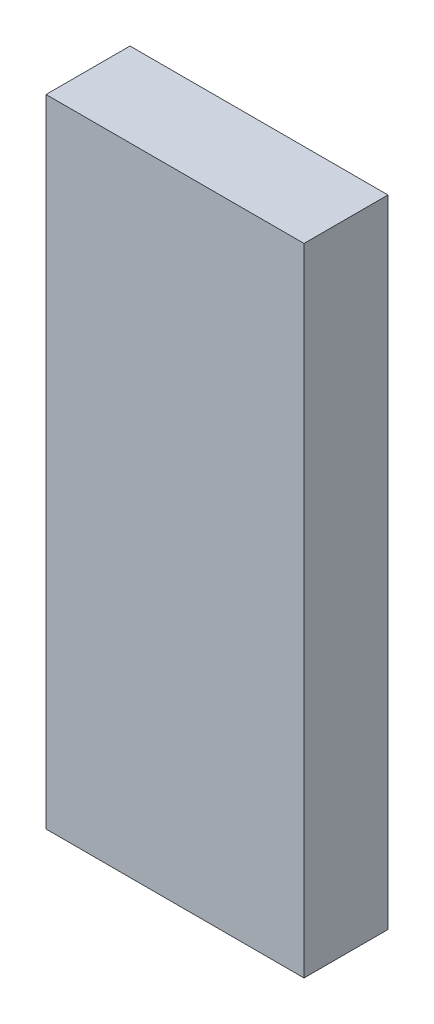
ISO-10303-21;
HEADER;
FILE_DESCRIPTION(('STEP AP214'),'2;1');
FILE_NAME('part.step','',(''),(''),'','','');
FILE_SCHEMA(('AUTOMOTIVE_DESIGN { 1 0 10303 214 1 1 1 1 }'));
ENDSEC;
DATA;
#1=APPLICATION_CONTEXT('core data for automotive mechanical design processes');
#2=APPLICATION_PROTOCOL_DEFINITION('international standard','automotive_design',2000,#1);
#3=PRODUCT_CONTEXT('',#1,'mechanical');
#4=PRODUCT('Part','Part','',(#3));
#5=PRODUCT_RELATED_PRODUCT_CATEGORY('part','',(#4));
#6=PRODUCT_DEFINITION_FORMATION('','',#4);
#7=PRODUCT_DEFINITION_CONTEXT('part definition',#1,'design');
#8=PRODUCT_DEFINITION('design','',#6,#7);
#9=PRODUCT_DEFINITION_SHAPE('','',#8);
#10=(LENGTH_UNIT() NAMED_UNIT(*) SI_UNIT(.MILLI.,.METRE.));
#11=(NAMED_UNIT(*) PLANE_ANGLE_UNIT() SI_UNIT($,.RADIAN.));
#12=(NAMED_UNIT(*) SI_UNIT($,.STERADIAN.) SOLID_ANGLE_UNIT());
#13=UNCERTAINTY_MEASURE_WITH_UNIT(LENGTH_MEASURE(1.E-05),#10,'distance_accuracy_value','');
#14=(GEOMETRIC_REPRESENTATION_CONTEXT(3) GLOBAL_UNCERTAINTY_ASSIGNED_CONTEXT((#13)) GLOBAL_UNIT_ASSIGNED_CONTEXT((#10,
#11,#12)) REPRESENTATION_CONTEXT('',''));
#15=CARTESIAN_POINT('',(0.,0.,0.));
#16=DIRECTION('',(0.,0.,1.));
#17=DIRECTION('',(1.,0.,0.));
#18=AXIS2_PLACEMENT_3D('',#15,#16,#17);
#19=CARTESIAN_POINT('',(1.05,-9.635,2.64));
#20=DIRECTION('',(0.,0.,1.));
#21=DIRECTION('',(1.,0.,0.));
#22=AXIS2_PLACEMENT_3D('',#19,#20,#21);
#23=PLANE('',#22);
#24=DIRECTION('',(0.,1.,0.));
#25=VECTOR('',#24,1.);
#26=CARTESIAN_POINT('',(8.35,-9.635,2.64));
#27=LINE('',#26,#25);
#28=CARTESIAN_POINT('',(8.35,8.365,2.64));
#29=VERTEX_POINT('',#28);
#30=CARTESIAN_POINT('',(8.35,-9.635,2.64));
#31=VERTEX_POINT('',#30);
#32=EDGE_CURVE('E75',#29,#31,#27,.F.);
#33=ORIENTED_EDGE('',*,*,#32,.F.);
#34=DIRECTION('',(1.,0.,0.));
#35=VECTOR('',#34,1.);
#36=CARTESIAN_POINT('',(1.05,8.365,2.64));
#37=LINE('',#36,#35);
#38=CARTESIAN_POINT('',(1.05,8.365,2.64));
#39=VERTEX_POINT('',#38);
#40=EDGE_CURVE('E57',#39,#29,#37,.T.);
#41=ORIENTED_EDGE('',*,*,#40,.F.);
#42=DIRECTION('',(0.,1.,0.));
#43=VECTOR('',#42,1.);
#44=CARTESIAN_POINT('',(1.05,-9.635,2.64));
#45=LINE('',#44,#43);
#46=CARTESIAN_POINT('',(1.05,-9.635,2.64));
#47=VERTEX_POINT('',#46);
#48=EDGE_CURVE('E19',#39,#47,#45,.F.);
#49=ORIENTED_EDGE('',*,*,#48,.T.);
#50=DIRECTION('',(1.,0.,0.));
#51=VECTOR('',#50,1.);
#52=CARTESIAN_POINT('',(1.05,-9.635,2.64));
#53=LINE('',#52,#51);
#54=EDGE_CURVE('E54',#47,#31,#53,.T.);
#55=ORIENTED_EDGE('',*,*,#54,.T.);
#56=EDGE_LOOP('',(#33,#41,#49,#55));
#57=FACE_BOUND('',#56,.T.);
#58=ADVANCED_FACE('F16',(#57),#23,.T.);
#59=CARTESIAN_POINT('',(1.05,-9.635,0.264));
#60=DIRECTION('',(1.,0.,0.));
#61=DIRECTION('',(0.,0.,-1.));
#62=AXIS2_PLACEMENT_3D('',#59,#60,#61);
#63=PLANE('',#62);
#64=DIRECTION('',(0.,0.,1.));
#65=VECTOR('',#64,1.);
#66=CARTESIAN_POINT('',(1.05,8.365,0.264));
#67=LINE('',#66,#65);
#68=CARTESIAN_POINT('',(1.05,8.365,0.264));
#69=VERTEX_POINT('',#68);
#70=EDGE_CURVE('E77',#69,#39,#67,.T.);
#71=ORIENTED_EDGE('',*,*,#70,.F.);
#72=DIRECTION('',(0.,1.,0.));
#73=VECTOR('',#72,1.);
#74=CARTESIAN_POINT('',(1.05,-9.635,0.264));
#75=LINE('',#74,#73);
#76=CARTESIAN_POINT('',(1.05,-9.635,0.264));
#77=VERTEX_POINT('',#76);
#78=EDGE_CURVE('E72',#69,#77,#75,.F.);
#79=ORIENTED_EDGE('',*,*,#78,.T.);
#80=DIRECTION('',(0.,0.,1.));
#81=VECTOR('',#80,1.);
#82=CARTESIAN_POINT('',(1.05,-9.635,0.264));
#83=LINE('',#82,#81);
#84=EDGE_CURVE('E62',#77,#47,#83,.T.);
#85=ORIENTED_EDGE('',*,*,#84,.T.);
#86=ORIENTED_EDGE('',*,*,#48,.F.);
#87=EDGE_LOOP('',(#71,#79,#85,#86));
#88=FACE_BOUND('',#87,.T.);
#89=ADVANCED_FACE('F71',(#88),#63,.F.);
#90=CARTESIAN_POINT('',(1.05,-9.635,0.264));
#91=DIRECTION('',(0.,1.,0.));
#92=DIRECTION('',(0.,0.,1.));
#93=AXIS2_PLACEMENT_3D('',#90,#91,#92);
#94=PLANE('',#93);
#95=ORIENTED_EDGE('',*,*,#54,.F.);
#96=ORIENTED_EDGE('',*,*,#84,.F.);
#97=DIRECTION('',(1.,0.,0.));
#98=VECTOR('',#97,1.);
#99=CARTESIAN_POINT('',(1.05,-9.635,0.264));
#100=LINE('',#99,#98);
#101=CARTESIAN_POINT('',(8.35,-9.635,0.264));
#102=VERTEX_POINT('',#101);
#103=EDGE_CURVE('E82',#77,#102,#100,.T.);
#104=ORIENTED_EDGE('',*,*,#103,.T.);
#105=DIRECTION('',(0.,0.,-1.));
#106=VECTOR('',#105,1.);
#107=CARTESIAN_POINT('',(8.35,-9.635,0.264));
#108=LINE('',#107,#106);
#109=EDGE_CURVE('E68',#31,#102,#108,.T.);
#110=ORIENTED_EDGE('',*,*,#109,.F.);
#111=EDGE_LOOP('',(#95,#96,#104,#110));
#112=FACE_BOUND('',#111,.T.);
#113=ADVANCED_FACE('F65',(#112),#94,.F.);
#114=CARTESIAN_POINT('',(8.35,-9.635,0.264));
#115=DIRECTION('',(1.,0.,0.));
#116=DIRECTION('',(0.,0.,-1.));
#117=AXIS2_PLACEMENT_3D('',#114,#115,#116);
#118=PLANE('',#117);
#119=DIRECTION('',(0.,0.,1.));
#120=VECTOR('',#119,1.);
#121=CARTESIAN_POINT('',(8.35,8.365,0.264));
#122=LINE('',#121,#120);
#123=CARTESIAN_POINT('',(8.35,8.365,0.264));
#124=VERTEX_POINT('',#123);
#125=EDGE_CURVE('E33',#29,#124,#122,.F.);
#126=ORIENTED_EDGE('',*,*,#125,.F.);
#127=ORIENTED_EDGE('',*,*,#32,.T.);
#128=ORIENTED_EDGE('',*,*,#109,.T.);
#129=DIRECTION('',(0.,1.,0.));
#130=VECTOR('',#129,1.);
#131=CARTESIAN_POINT('',(8.35,-9.635,0.264));
#132=LINE('',#131,#130);
#133=EDGE_CURVE('E25',#102,#124,#132,.T.);
#134=ORIENTED_EDGE('',*,*,#133,.T.);
#135=EDGE_LOOP('',(#126,#127,#128,#134));
#136=FACE_BOUND('',#135,.T.);
#137=ADVANCED_FACE('F87',(#136),#118,.T.);
#138=CARTESIAN_POINT('',(1.05,8.365,0.264));
#139=DIRECTION('',(0.,1.,0.));
#140=DIRECTION('',(0.,0.,1.));
#141=AXIS2_PLACEMENT_3D('',#138,#139,#140);
#142=PLANE('',#141);
#143=ORIENTED_EDGE('',*,*,#40,.T.);
#144=ORIENTED_EDGE('',*,*,#125,.T.);
#145=DIRECTION('',(1.,0.,0.));
#146=VECTOR('',#145,1.);
#147=CARTESIAN_POINT('',(1.05,8.365,0.264));
#148=LINE('',#147,#146);
#149=EDGE_CURVE('E11',#124,#69,#148,.F.);
#150=ORIENTED_EDGE('',*,*,#149,.T.);
#151=ORIENTED_EDGE('',*,*,#70,.T.);
#152=EDGE_LOOP('',(#143,#144,#150,#151));
#153=FACE_BOUND('',#152,.T.);
#154=ADVANCED_FACE('F90',(#153),#142,.T.);
#155=CARTESIAN_POINT('',(1.05,-9.635,0.264));
#156=DIRECTION('',(0.,0.,1.));
#157=DIRECTION('',(1.,0.,0.));
#158=AXIS2_PLACEMENT_3D('',#155,#156,#157);
#159=PLANE('',#158);
#160=ORIENTED_EDGE('',*,*,#133,.F.);
#161=ORIENTED_EDGE('',*,*,#103,.F.);
#162=ORIENTED_EDGE('',*,*,#78,.F.);
#163=ORIENTED_EDGE('',*,*,#149,.F.);
#164=EDGE_LOOP('',(#160,#161,#162,#163));
#165=FACE_BOUND('',#164,.T.);
#166=ADVANCED_FACE('F89',(#165),#159,.F.);
#167=CLOSED_SHELL('',(#58,#89,#113,#137,#154,#166));
#168=MANIFOLD_SOLID_BREP('B1',#167);
#169=ADVANCED_BREP_SHAPE_REPRESENTATION('',(#18,#168),#14);
#170=SHAPE_DEFINITION_REPRESENTATION(#9,#169);
ENDSEC;
END-ISO-10303-21;
